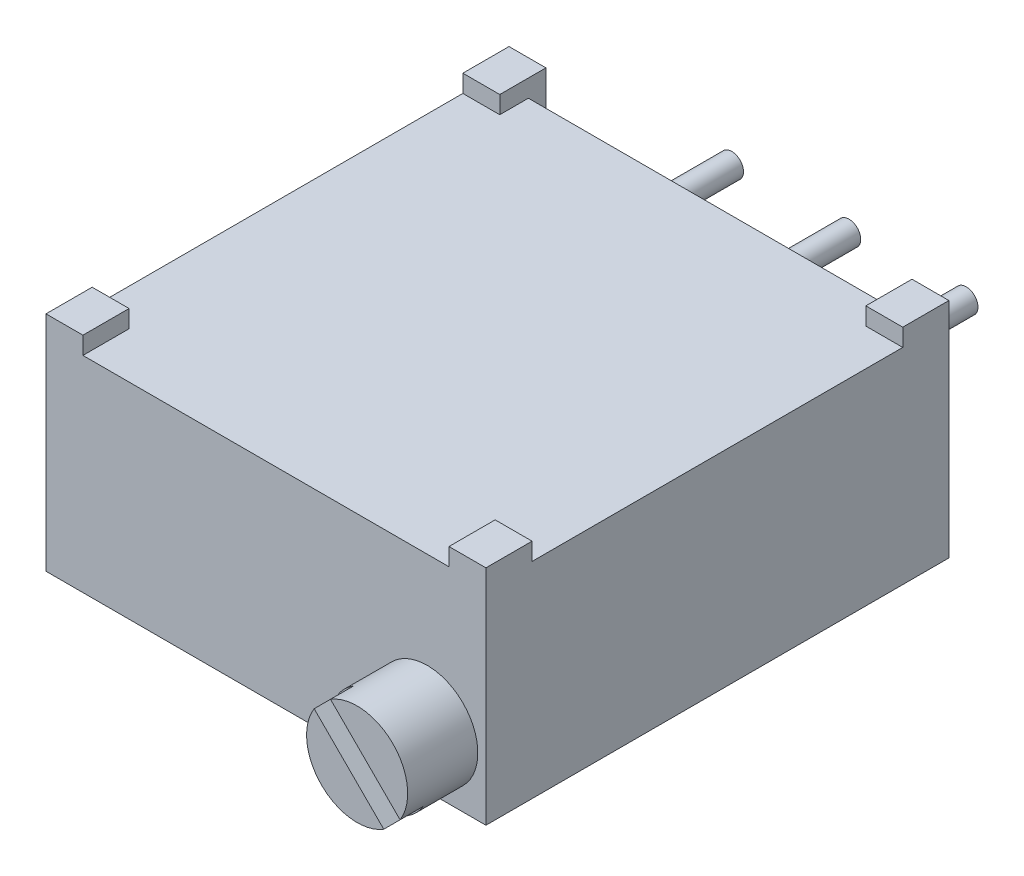
ISO-10303-21;
HEADER;
FILE_DESCRIPTION(('STEP AP214'),'2;1');
FILE_NAME('part.step','',(''),(''),'','','');
FILE_SCHEMA(('AUTOMOTIVE_DESIGN { 1 0 10303 214 1 1 1 1 }'));
ENDSEC;
DATA;
#1=APPLICATION_CONTEXT('core data for automotive mechanical design processes');
#2=APPLICATION_PROTOCOL_DEFINITION('international standard','automotive_design',2000,#1);
#3=PRODUCT_CONTEXT('',#1,'mechanical');
#4=PRODUCT('Part','Part','',(#3));
#5=PRODUCT_RELATED_PRODUCT_CATEGORY('part','',(#4));
#6=PRODUCT_DEFINITION_FORMATION('','',#4);
#7=PRODUCT_DEFINITION_CONTEXT('part definition',#1,'design');
#8=PRODUCT_DEFINITION('design','',#6,#7);
#9=PRODUCT_DEFINITION_SHAPE('','',#8);
#10=(LENGTH_UNIT() NAMED_UNIT(*) SI_UNIT(.MILLI.,.METRE.));
#11=(NAMED_UNIT(*) PLANE_ANGLE_UNIT() SI_UNIT($,.RADIAN.));
#12=(NAMED_UNIT(*) SI_UNIT($,.STERADIAN.) SOLID_ANGLE_UNIT());
#13=UNCERTAINTY_MEASURE_WITH_UNIT(LENGTH_MEASURE(1.E-05),#10,'distance_accuracy_value','');
#14=(GEOMETRIC_REPRESENTATION_CONTEXT(3) GLOBAL_UNCERTAINTY_ASSIGNED_CONTEXT((#13)) GLOBAL_UNIT_ASSIGNED_CONTEXT((#10,
#11,#12)) REPRESENTATION_CONTEXT('',''));
#15=CARTESIAN_POINT('',(0.,0.,0.));
#16=DIRECTION('',(0.,0.,1.));
#17=DIRECTION('',(1.,0.,0.));
#18=AXIS2_PLACEMENT_3D('',#15,#16,#17);
#19=CARTESIAN_POINT('',(-3.965,2.416,0.38));
#20=DIRECTION('',(0.,0.,1.));
#21=DIRECTION('',(1.,0.,0.));
#22=AXIS2_PLACEMENT_3D('',#19,#20,#21);
#23=PLANE('',#22);
#24=CARTESIAN_POINT('',(2.54,0.00499999999999949,0.380000000000001));
#25=DIRECTION('',(0.,0.,1.));
#26=DIRECTION('',(1.,0.,0.));
#27=AXIS2_PLACEMENT_3D('',#24,#25,#26);
#28=CIRCLE('',#27,0.255);
#29=CARTESIAN_POINT('',(2.795,0.00499999999999949,0.380000000000001));
#30=VERTEX_POINT('',#29);
#31=EDGE_CURVE('E40',#30,#30,#28,.F.);
#32=ORIENTED_EDGE('',*,*,#31,.F.);
#33=EDGE_LOOP('',(#32));
#34=FACE_BOUND('',#33,.T.);
#35=DIRECTION('',(-1.,0.,0.));
#36=VECTOR('',#35,1.);
#37=CARTESIAN_POINT('',(3.965,2.035,0.380000000000001));
#38=LINE('',#37,#36);
#39=CARTESIAN_POINT('',(3.965,2.035,0.380000000000001));
#40=VERTEX_POINT('',#39);
#41=CARTESIAN_POINT('',(-3.965,2.035,0.38));
#42=VERTEX_POINT('',#41);
#43=EDGE_CURVE('E216',#40,#42,#38,.T.);
#44=ORIENTED_EDGE('',*,*,#43,.F.);
#45=DIRECTION('',(0.,-1.,0.));
#46=VECTOR('',#45,1.);
#47=CARTESIAN_POINT('',(3.965,2.416,0.380000000000001));
#48=LINE('',#47,#46);
#49=CARTESIAN_POINT('',(3.965,-2.415,0.380000000000001));
#50=VERTEX_POINT('',#49);
#51=EDGE_CURVE('E300',#40,#50,#48,.T.);
#52=ORIENTED_EDGE('',*,*,#51,.T.);
#53=DIRECTION('',(-1.,0.,0.));
#54=VECTOR('',#53,1.);
#55=CARTESIAN_POINT('',(-3.965,-2.415,0.38));
#56=LINE('',#55,#54);
#57=CARTESIAN_POINT('',(-3.965,-2.415,0.38));
#58=VERTEX_POINT('',#57);
#59=EDGE_CURVE('E297',#50,#58,#56,.T.);
#60=ORIENTED_EDGE('',*,*,#59,.T.);
#61=DIRECTION('',(0.,-1.,0.));
#62=VECTOR('',#61,1.);
#63=CARTESIAN_POINT('',(-3.965,2.416,0.38));
#64=LINE('',#63,#62);
#65=EDGE_CURVE('E301',#42,#58,#64,.T.);
#66=ORIENTED_EDGE('',*,*,#65,.F.);
#67=EDGE_LOOP('',(#44,#52,#60,#66));
#68=FACE_BOUND('',#67,.T.);
#69=CARTESIAN_POINT('',(0.,0.0049999999999998,0.380000000000001));
#70=DIRECTION('',(0.,0.,1.));
#71=DIRECTION('',(1.,0.,0.));
#72=AXIS2_PLACEMENT_3D('',#69,#70,#71);
#73=CIRCLE('',#72,0.255);
#74=CARTESIAN_POINT('',(0.255,0.0049999999999998,0.380000000000001));
#75=VERTEX_POINT('',#74);
#76=EDGE_CURVE('E348',#75,#75,#73,.F.);
#77=ORIENTED_EDGE('',*,*,#76,.F.);
#78=EDGE_LOOP('',(#77));
#79=FACE_BOUND('',#78,.T.);
#80=CARTESIAN_POINT('',(-2.54,0.0049999999999998,0.38));
#81=DIRECTION('',(0.,0.,1.));
#82=DIRECTION('',(1.,0.,0.));
#83=AXIS2_PLACEMENT_3D('',#80,#81,#82);
#84=CIRCLE('',#83,0.255);
#85=CARTESIAN_POINT('',(-2.285,0.0049999999999998,0.38));
#86=VERTEX_POINT('',#85);
#87=EDGE_CURVE('E11',#86,#86,#84,.F.);
#88=ORIENTED_EDGE('',*,*,#87,.F.);
#89=EDGE_LOOP('',(#88));
#90=FACE_BOUND('',#89,.T.);
#91=ADVANCED_FACE('F32',(#34,#68,#79,#90),#23,.F.);
#92=CARTESIAN_POINT('',(3.495,-1.145,11.55));
#93=DIRECTION('',(0.,0.,1.));
#94=DIRECTION('',(1.,0.,0.));
#95=AXIS2_PLACEMENT_3D('',#92,#93,#94);
#96=PLANE('',#95);
#97=DIRECTION('',(-0.707106781186546,0.707106781186548,0.));
#98=VECTOR('',#97,1.);
#99=CARTESIAN_POINT('',(2.91794481748833,-0.214391426895054,11.55));
#100=LINE('',#99,#98);
#101=CARTESIAN_POINT('',(4.42560857310494,-1.72205518251167,11.55));
#102=VERTEX_POINT('',#101);
#103=CARTESIAN_POINT('',(2.91794481748833,-0.214391426895054,11.55));
#104=VERTEX_POINT('',#103);
#105=EDGE_CURVE('E197',#102,#104,#100,.T.);
#106=ORIENTED_EDGE('',*,*,#105,.F.);
#107=CARTESIAN_POINT('',(3.495,-1.145,11.55));
#108=DIRECTION('',(0.,0.,1.));
#109=DIRECTION('',(1.,0.,0.));
#110=AXIS2_PLACEMENT_3D('',#107,#108,#109);
#111=CIRCLE('',#110,1.095);
#112=EDGE_CURVE('E210',#102,#104,#111,.T.);
#113=ORIENTED_EDGE('',*,*,#112,.T.);
#114=EDGE_LOOP('',(#106,#113));
#115=FACE_BOUND('',#114,.T.);
#116=ADVANCED_FACE('F357',(#115),#96,.T.);
#117=CARTESIAN_POINT('',(-4.765,2.415,10.03));
#118=DIRECTION('',(0.,0.,-1.));
#119=DIRECTION('',(-1.,0.,0.));
#120=AXIS2_PLACEMENT_3D('',#117,#118,#119);
#121=PLANE('',#120);
#122=DIRECTION('',(1.,0.,0.));
#123=VECTOR('',#122,1.);
#124=CARTESIAN_POINT('',(-4.765,2.415,10.03));
#125=LINE('',#124,#123);
#126=CARTESIAN_POINT('',(3.965,2.415,10.03));
#127=VERTEX_POINT('',#126);
#128=CARTESIAN_POINT('',(4.765,2.415,10.03));
#129=VERTEX_POINT('',#128);
#130=EDGE_CURVE('E310',#127,#129,#125,.T.);
#131=ORIENTED_EDGE('',*,*,#130,.F.);
#132=DIRECTION('',(0.,1.,0.));
#133=VECTOR('',#132,1.);
#134=CARTESIAN_POINT('',(3.965,2.035,10.03));
#135=LINE('',#134,#133);
#136=CARTESIAN_POINT('',(3.965,2.035,10.03));
#137=VERTEX_POINT('',#136);
#138=EDGE_CURVE('E274',#137,#127,#135,.T.);
#139=ORIENTED_EDGE('',*,*,#138,.F.);
#140=DIRECTION('',(1.,0.,0.));
#141=VECTOR('',#140,1.);
#142=CARTESIAN_POINT('',(-3.965,2.035,10.03));
#143=LINE('',#142,#141);
#144=CARTESIAN_POINT('',(-3.965,2.035,10.03));
#145=VERTEX_POINT('',#144);
#146=EDGE_CURVE('E235',#145,#137,#143,.T.);
#147=ORIENTED_EDGE('',*,*,#146,.F.);
#148=DIRECTION('',(0.,1.,0.));
#149=VECTOR('',#148,1.);
#150=CARTESIAN_POINT('',(-3.965,2.035,10.03));
#151=LINE('',#150,#149);
#152=CARTESIAN_POINT('',(-3.965,2.415,10.03));
#153=VERTEX_POINT('',#152);
#154=EDGE_CURVE('E276',#145,#153,#151,.T.);
#155=ORIENTED_EDGE('',*,*,#154,.T.);
#156=CARTESIAN_POINT('',(-4.765,2.415,10.03));
#157=VERTEX_POINT('',#156);
#158=EDGE_CURVE('E312',#157,#153,#125,.T.);
#159=ORIENTED_EDGE('',*,*,#158,.F.);
#160=DIRECTION('',(0.,-1.,0.));
#161=VECTOR('',#160,1.);
#162=CARTESIAN_POINT('',(-4.765,2.415,10.03));
#163=LINE('',#162,#161);
#164=CARTESIAN_POINT('',(-4.765,-2.415,10.03));
#165=VERTEX_POINT('',#164);
#166=EDGE_CURVE('E342',#157,#165,#163,.T.);
#167=ORIENTED_EDGE('',*,*,#166,.T.);
#168=DIRECTION('',(1.,0.,0.));
#169=VECTOR('',#168,1.);
#170=CARTESIAN_POINT('',(-4.765,-2.415,10.03));
#171=LINE('',#170,#169);
#172=CARTESIAN_POINT('',(4.765,-2.415,10.03));
#173=VERTEX_POINT('',#172);
#174=EDGE_CURVE('E326',#165,#173,#171,.T.);
#175=ORIENTED_EDGE('',*,*,#174,.T.);
#176=DIRECTION('',(0.,-1.,0.));
#177=VECTOR('',#176,1.);
#178=CARTESIAN_POINT('',(4.765,2.415,10.03));
#179=LINE('',#178,#177);
#180=EDGE_CURVE('E339',#129,#173,#179,.T.);
#181=ORIENTED_EDGE('',*,*,#180,.F.);
#182=EDGE_LOOP('',(#131,#139,#147,#155,#159,#167,#175,#181));
#183=FACE_BOUND('',#182,.T.);
#184=CARTESIAN_POINT('',(3.495,-1.145,10.03));
#185=DIRECTION('',(0.,0.,-1.));
#186=DIRECTION('',(-1.,0.,0.));
#187=AXIS2_PLACEMENT_3D('',#184,#185,#186);
#188=CIRCLE('',#187,1.095);
#189=CARTESIAN_POINT('',(2.4,-1.145,10.03));
#190=VERTEX_POINT('',#189);
#191=EDGE_CURVE('E345',#190,#190,#188,.F.);
#192=ORIENTED_EDGE('',*,*,#191,.F.);
#193=EDGE_LOOP('',(#192));
#194=FACE_BOUND('',#193,.T.);
#195=ADVANCED_FACE('F461',(#183,#194),#121,.F.);
#196=CARTESIAN_POINT('',(0.,2.415,0.));
#197=DIRECTION('',(0.,-1.,0.));
#198=DIRECTION('',(0.,0.,-1.));
#199=AXIS2_PLACEMENT_3D('',#196,#197,#198);
#200=PLANE('',#199);
#201=DIRECTION('',(0.,0.,-1.));
#202=VECTOR('',#201,1.);
#203=CARTESIAN_POINT('',(3.965,2.415,-0.619999999999999));
#204=LINE('',#203,#202);
#205=CARTESIAN_POINT('',(3.965,2.415,1.));
#206=VERTEX_POINT('',#205);
#207=CARTESIAN_POINT('',(3.965,2.415,0.));
#208=VERTEX_POINT('',#207);
#209=EDGE_CURVE('E303',#206,#208,#204,.T.);
#210=ORIENTED_EDGE('',*,*,#209,.F.);
#211=DIRECTION('',(-1.,0.,0.));
#212=VECTOR('',#211,1.);
#213=CARTESIAN_POINT('',(4.765,2.415,0.999999999999999));
#214=LINE('',#213,#212);
#215=CARTESIAN_POINT('',(4.765,2.415,0.999999999999999));
#216=VERTEX_POINT('',#215);
#217=EDGE_CURVE('E217',#216,#206,#214,.T.);
#218=ORIENTED_EDGE('',*,*,#217,.F.);
#219=DIRECTION('',(0.,0.,-1.));
#220=VECTOR('',#219,1.);
#221=CARTESIAN_POINT('',(4.765,2.415,10.03));
#222=LINE('',#221,#220);
#223=CARTESIAN_POINT('',(4.765,2.415,0.));
#224=VERTEX_POINT('',#223);
#225=EDGE_CURVE('E315',#216,#224,#222,.T.);
#226=ORIENTED_EDGE('',*,*,#225,.T.);
#227=DIRECTION('',(-1.,0.,0.));
#228=VECTOR('',#227,1.);
#229=CARTESIAN_POINT('',(-4.765,2.415,0.));
#230=LINE('',#229,#228);
#231=EDGE_CURVE('E320',#224,#208,#230,.T.);
#232=ORIENTED_EDGE('',*,*,#231,.T.);
#233=EDGE_LOOP('',(#210,#218,#226,#232));
#234=FACE_BOUND('',#233,.T.);
#235=ADVANCED_FACE('F449',(#234),#200,.F.);
#236=CARTESIAN_POINT('',(4.765,2.415,9.03));
#237=VERTEX_POINT('',#236);
#238=EDGE_CURVE('E316',#129,#237,#222,.T.);
#239=ORIENTED_EDGE('',*,*,#238,.T.);
#240=DIRECTION('',(1.,0.,0.));
#241=VECTOR('',#240,1.);
#242=CARTESIAN_POINT('',(3.965,2.415,9.03));
#243=LINE('',#242,#241);
#244=CARTESIAN_POINT('',(3.965,2.415,9.03));
#245=VERTEX_POINT('',#244);
#246=EDGE_CURVE('E260',#245,#237,#243,.T.);
#247=ORIENTED_EDGE('',*,*,#246,.F.);
#248=DIRECTION('',(0.,0.,-1.));
#249=VECTOR('',#248,1.);
#250=CARTESIAN_POINT('',(3.965,2.415,10.03));
#251=LINE('',#250,#249);
#252=EDGE_CURVE('E257',#127,#245,#251,.T.);
#253=ORIENTED_EDGE('',*,*,#252,.F.);
#254=ORIENTED_EDGE('',*,*,#130,.T.);
#255=EDGE_LOOP('',(#239,#247,#253,#254));
#256=FACE_BOUND('',#255,.T.);
#257=ADVANCED_FACE('F468',(#256),#200,.F.);
#258=ORIENTED_EDGE('',*,*,#158,.T.);
#259=DIRECTION('',(0.,0.,1.));
#260=VECTOR('',#259,1.);
#261=CARTESIAN_POINT('',(-3.965,2.415,9.03));
#262=LINE('',#261,#260);
#263=CARTESIAN_POINT('',(-3.965,2.415,9.03));
#264=VERTEX_POINT('',#263);
#265=EDGE_CURVE('E255',#264,#153,#262,.T.);
#266=ORIENTED_EDGE('',*,*,#265,.F.);
#267=DIRECTION('',(1.,0.,0.));
#268=VECTOR('',#267,1.);
#269=CARTESIAN_POINT('',(-4.765,2.415,9.03));
#270=LINE('',#269,#268);
#271=CARTESIAN_POINT('',(-4.765,2.415,9.03));
#272=VERTEX_POINT('',#271);
#273=EDGE_CURVE('E252',#272,#264,#270,.T.);
#274=ORIENTED_EDGE('',*,*,#273,.F.);
#275=DIRECTION('',(0.,0.,1.));
#276=VECTOR('',#275,1.);
#277=CARTESIAN_POINT('',(-4.765,2.415,10.03));
#278=LINE('',#277,#276);
#279=EDGE_CURVE('E311',#272,#157,#278,.T.);
#280=ORIENTED_EDGE('',*,*,#279,.T.);
#281=EDGE_LOOP('',(#258,#266,#274,#280));
#282=FACE_BOUND('',#281,.T.);
#283=ADVANCED_FACE('F450',(#282),#200,.F.);
#284=CARTESIAN_POINT('',(-4.765,2.415,0.));
#285=DIRECTION('',(0.,0.,1.));
#286=DIRECTION('',(1.,0.,0.));
#287=AXIS2_PLACEMENT_3D('',#284,#285,#286);
#288=PLANE('',#287);
#289=CARTESIAN_POINT('',(-3.965,2.415,0.));
#290=VERTEX_POINT('',#289);
#291=CARTESIAN_POINT('',(-4.765,2.415,0.));
#292=VERTEX_POINT('',#291);
#293=EDGE_CURVE('E319',#290,#292,#230,.T.);
#294=ORIENTED_EDGE('',*,*,#293,.F.);
#295=DIRECTION('',(0.,1.,0.));
#296=VECTOR('',#295,1.);
#297=CARTESIAN_POINT('',(-3.965,2.416,0.));
#298=LINE('',#297,#296);
#299=CARTESIAN_POINT('',(-3.965,-2.415,0.));
#300=VERTEX_POINT('',#299);
#301=EDGE_CURVE('E289',#300,#290,#298,.T.);
#302=ORIENTED_EDGE('',*,*,#301,.F.);
#303=DIRECTION('',(-1.,0.,0.));
#304=VECTOR('',#303,1.);
#305=CARTESIAN_POINT('',(-4.765,-2.415,0.));
#306=LINE('',#305,#304);
#307=CARTESIAN_POINT('',(-4.765,-2.415,0.));
#308=VERTEX_POINT('',#307);
#309=EDGE_CURVE('E330',#300,#308,#306,.T.);
#310=ORIENTED_EDGE('',*,*,#309,.T.);
#311=DIRECTION('',(0.,-1.,0.));
#312=VECTOR('',#311,1.);
#313=CARTESIAN_POINT('',(-4.765,2.415,0.));
#314=LINE('',#313,#312);
#315=EDGE_CURVE('E323',#292,#308,#314,.T.);
#316=ORIENTED_EDGE('',*,*,#315,.F.);
#317=EDGE_LOOP('',(#294,#302,#310,#316));
#318=FACE_BOUND('',#317,.T.);
#319=ADVANCED_FACE('F458',(#318),#288,.F.);
#320=CARTESIAN_POINT('',(-4.765,2.415,10.03));
#321=DIRECTION('',(1.,0.,0.));
#322=DIRECTION('',(0.,0.,-1.));
#323=AXIS2_PLACEMENT_3D('',#320,#321,#322);
#324=PLANE('',#323);
#325=ORIENTED_EDGE('',*,*,#279,.F.);
#326=DIRECTION('',(0.,1.,0.));
#327=VECTOR('',#326,1.);
#328=CARTESIAN_POINT('',(-4.765,2.035,9.03));
#329=LINE('',#328,#327);
#330=CARTESIAN_POINT('',(-4.765,2.035,9.03));
#331=VERTEX_POINT('',#330);
#332=EDGE_CURVE('E281',#331,#272,#329,.T.);
#333=ORIENTED_EDGE('',*,*,#332,.F.);
#334=DIRECTION('',(0.,0.,1.));
#335=VECTOR('',#334,1.);
#336=CARTESIAN_POINT('',(-4.765,2.035,1.));
#337=LINE('',#336,#335);
#338=CARTESIAN_POINT('',(-4.765,2.035,1.));
#339=VERTEX_POINT('',#338);
#340=EDGE_CURVE('E226',#339,#331,#337,.T.);
#341=ORIENTED_EDGE('',*,*,#340,.F.);
#342=DIRECTION('',(0.,1.,0.));
#343=VECTOR('',#342,1.);
#344=CARTESIAN_POINT('',(-4.765,2.035,1.));
#345=LINE('',#344,#343);
#346=CARTESIAN_POINT('',(-4.765,2.415,1.));
#347=VERTEX_POINT('',#346);
#348=EDGE_CURVE('E283',#339,#347,#345,.T.);
#349=ORIENTED_EDGE('',*,*,#348,.T.);
#350=EDGE_CURVE('E307',#292,#347,#278,.T.);
#351=ORIENTED_EDGE('',*,*,#350,.F.);
#352=ORIENTED_EDGE('',*,*,#315,.T.);
#353=DIRECTION('',(0.,0.,1.));
#354=VECTOR('',#353,1.);
#355=CARTESIAN_POINT('',(-4.765,-2.415,10.03));
#356=LINE('',#355,#354);
#357=EDGE_CURVE('E306',#308,#165,#356,.T.);
#358=ORIENTED_EDGE('',*,*,#357,.T.);
#359=ORIENTED_EDGE('',*,*,#166,.F.);
#360=EDGE_LOOP('',(#325,#333,#341,#349,#351,#352,#358,#359));
#361=FACE_BOUND('',#360,.T.);
#362=ADVANCED_FACE('F34',(#361),#324,.F.);
#363=CARTESIAN_POINT('',(4.765,2.415,10.03));
#364=DIRECTION('',(-1.,0.,0.));
#365=DIRECTION('',(0.,0.,1.));
#366=AXIS2_PLACEMENT_3D('',#363,#364,#365);
#367=PLANE('',#366);
#368=ORIENTED_EDGE('',*,*,#225,.F.);
#369=DIRECTION('',(0.,1.,0.));
#370=VECTOR('',#369,1.);
#371=CARTESIAN_POINT('',(4.765,2.035,0.999999999999999));
#372=LINE('',#371,#370);
#373=CARTESIAN_POINT('',(4.765,2.035,0.999999999999999));
#374=VERTEX_POINT('',#373);
#375=EDGE_CURVE('E267',#374,#216,#372,.T.);
#376=ORIENTED_EDGE('',*,*,#375,.F.);
#377=DIRECTION('',(0.,0.,-1.));
#378=VECTOR('',#377,1.);
#379=CARTESIAN_POINT('',(4.765,2.035,9.03));
#380=LINE('',#379,#378);
#381=CARTESIAN_POINT('',(4.765,2.035,9.03));
#382=VERTEX_POINT('',#381);
#383=EDGE_CURVE('E244',#382,#374,#380,.T.);
#384=ORIENTED_EDGE('',*,*,#383,.F.);
#385=DIRECTION('',(0.,1.,0.));
#386=VECTOR('',#385,1.);
#387=CARTESIAN_POINT('',(4.765,2.035,9.03));
#388=LINE('',#387,#386);
#389=EDGE_CURVE('E269',#382,#237,#388,.T.);
#390=ORIENTED_EDGE('',*,*,#389,.T.);
#391=ORIENTED_EDGE('',*,*,#238,.F.);
#392=ORIENTED_EDGE('',*,*,#180,.T.);
#393=DIRECTION('',(0.,0.,-1.));
#394=VECTOR('',#393,1.);
#395=CARTESIAN_POINT('',(4.765,-2.415,10.03));
#396=LINE('',#395,#394);
#397=CARTESIAN_POINT('',(4.765,-2.415,0.));
#398=VERTEX_POINT('',#397);
#399=EDGE_CURVE('E328',#173,#398,#396,.T.);
#400=ORIENTED_EDGE('',*,*,#399,.T.);
#401=DIRECTION('',(0.,-1.,0.));
#402=VECTOR('',#401,1.);
#403=CARTESIAN_POINT('',(4.765,2.415,0.));
#404=LINE('',#403,#402);
#405=EDGE_CURVE('E336',#224,#398,#404,.T.);
#406=ORIENTED_EDGE('',*,*,#405,.F.);
#407=EDGE_LOOP('',(#368,#376,#384,#390,#391,#392,#400,#406));
#408=FACE_BOUND('',#407,.T.);
#409=ADVANCED_FACE('F456',(#408),#367,.F.);
#410=CARTESIAN_POINT('',(3.965,-2.415,0.));
#411=VERTEX_POINT('',#410);
#412=EDGE_CURVE('E331',#398,#411,#306,.T.);
#413=ORIENTED_EDGE('',*,*,#412,.T.);
#414=DIRECTION('',(0.,-1.,0.));
#415=VECTOR('',#414,1.);
#416=CARTESIAN_POINT('',(3.965,2.416,0.));
#417=LINE('',#416,#415);
#418=EDGE_CURVE('E55',#208,#411,#417,.T.);
#419=ORIENTED_EDGE('',*,*,#418,.F.);
#420=ORIENTED_EDGE('',*,*,#231,.F.);
#421=ORIENTED_EDGE('',*,*,#405,.T.);
#422=EDGE_LOOP('',(#413,#419,#420,#421));
#423=FACE_BOUND('',#422,.T.);
#424=ADVANCED_FACE('F447',(#423),#288,.F.);
#425=ORIENTED_EDGE('',*,*,#350,.T.);
#426=DIRECTION('',(-1.,0.,0.));
#427=VECTOR('',#426,1.);
#428=CARTESIAN_POINT('',(-3.965,2.415,1.));
#429=LINE('',#428,#427);
#430=CARTESIAN_POINT('',(-3.965,2.415,1.));
#431=VERTEX_POINT('',#430);
#432=EDGE_CURVE('E250',#431,#347,#429,.T.);
#433=ORIENTED_EDGE('',*,*,#432,.F.);
#434=DIRECTION('',(0.,0.,1.));
#435=VECTOR('',#434,1.);
#436=CARTESIAN_POINT('',(-3.965,2.415,-0.62));
#437=LINE('',#436,#435);
#438=EDGE_CURVE('E291',#290,#431,#437,.T.);
#439=ORIENTED_EDGE('',*,*,#438,.F.);
#440=ORIENTED_EDGE('',*,*,#293,.T.);
#441=EDGE_LOOP('',(#425,#433,#439,#440));
#442=FACE_BOUND('',#441,.T.);
#443=ADVANCED_FACE('F444',(#442),#200,.F.);
#444=CARTESIAN_POINT('',(0.,-2.415,0.));
#445=DIRECTION('',(0.,-1.,0.));
#446=DIRECTION('',(0.,0.,-1.));
#447=AXIS2_PLACEMENT_3D('',#444,#445,#446);
#448=PLANE('',#447);
#449=DIRECTION('',(0.,0.,-1.));
#450=VECTOR('',#449,1.);
#451=CARTESIAN_POINT('',(-3.965,-2.415,-0.62));
#452=LINE('',#451,#450);
#453=EDGE_CURVE('E293',#58,#300,#452,.T.);
#454=ORIENTED_EDGE('',*,*,#453,.F.);
#455=ORIENTED_EDGE('',*,*,#59,.F.);
#456=DIRECTION('',(0.,0.,1.));
#457=VECTOR('',#456,1.);
#458=CARTESIAN_POINT('',(3.965,-2.415,-0.619999999999999));
#459=LINE('',#458,#457);
#460=EDGE_CURVE('E295',#411,#50,#459,.T.);
#461=ORIENTED_EDGE('',*,*,#460,.F.);
#462=ORIENTED_EDGE('',*,*,#412,.F.);
#463=ORIENTED_EDGE('',*,*,#399,.F.);
#464=ORIENTED_EDGE('',*,*,#174,.F.);
#465=ORIENTED_EDGE('',*,*,#357,.F.);
#466=ORIENTED_EDGE('',*,*,#309,.F.);
#467=EDGE_LOOP('',(#454,#455,#461,#462,#463,#464,#465,#466));
#468=FACE_BOUND('',#467,.T.);
#469=ADVANCED_FACE('F442',(#468),#448,.T.);
#470=CARTESIAN_POINT('',(-3.965,2.416,-0.62));
#471=DIRECTION('',(-1.,0.,0.));
#472=DIRECTION('',(0.,0.,1.));
#473=AXIS2_PLACEMENT_3D('',#470,#471,#472);
#474=PLANE('',#473);
#475=ORIENTED_EDGE('',*,*,#301,.T.);
#476=ORIENTED_EDGE('',*,*,#438,.T.);
#477=DIRECTION('',(0.,1.,0.));
#478=VECTOR('',#477,1.);
#479=CARTESIAN_POINT('',(-3.965,2.035,1.));
#480=LINE('',#479,#478);
#481=CARTESIAN_POINT('',(-3.965,2.035,1.));
#482=VERTEX_POINT('',#481);
#483=EDGE_CURVE('E249',#482,#431,#480,.T.);
#484=ORIENTED_EDGE('',*,*,#483,.F.);
#485=DIRECTION('',(0.,0.,1.));
#486=VECTOR('',#485,1.);
#487=CARTESIAN_POINT('',(-3.965,2.035,0.38));
#488=LINE('',#487,#486);
#489=EDGE_CURVE('E220',#42,#482,#488,.T.);
#490=ORIENTED_EDGE('',*,*,#489,.F.);
#491=ORIENTED_EDGE('',*,*,#65,.T.);
#492=ORIENTED_EDGE('',*,*,#453,.T.);
#493=EDGE_LOOP('',(#475,#476,#484,#490,#491,#492));
#494=FACE_BOUND('',#493,.T.);
#495=ADVANCED_FACE('F439',(#494),#474,.F.);
#496=CARTESIAN_POINT('',(3.965,2.416,-0.619999999999999));
#497=DIRECTION('',(1.,0.,0.));
#498=DIRECTION('',(0.,0.,-1.));
#499=AXIS2_PLACEMENT_3D('',#496,#497,#498);
#500=PLANE('',#499);
#501=ORIENTED_EDGE('',*,*,#418,.T.);
#502=ORIENTED_EDGE('',*,*,#460,.T.);
#503=ORIENTED_EDGE('',*,*,#51,.F.);
#504=DIRECTION('',(0.,0.,-1.));
#505=VECTOR('',#504,1.);
#506=CARTESIAN_POINT('',(3.965,2.035,1.));
#507=LINE('',#506,#505);
#508=CARTESIAN_POINT('',(3.965,2.035,1.));
#509=VERTEX_POINT('',#508);
#510=EDGE_CURVE('E214',#509,#40,#507,.T.);
#511=ORIENTED_EDGE('',*,*,#510,.F.);
#512=DIRECTION('',(0.,1.,0.));
#513=VECTOR('',#512,1.);
#514=CARTESIAN_POINT('',(3.965,2.035,1.));
#515=LINE('',#514,#513);
#516=EDGE_CURVE('E264',#509,#206,#515,.T.);
#517=ORIENTED_EDGE('',*,*,#516,.T.);
#518=ORIENTED_EDGE('',*,*,#209,.T.);
#519=EDGE_LOOP('',(#501,#502,#503,#511,#517,#518));
#520=FACE_BOUND('',#519,.T.);
#521=ADVANCED_FACE('F417',(#520),#500,.F.);
#522=CARTESIAN_POINT('',(4.765,2.035,0.999999999999999));
#523=DIRECTION('',(0.,0.,-1.));
#524=DIRECTION('',(-1.,0.,0.));
#525=AXIS2_PLACEMENT_3D('',#522,#523,#524);
#526=PLANE('',#525);
#527=ORIENTED_EDGE('',*,*,#217,.T.);
#528=ORIENTED_EDGE('',*,*,#516,.F.);
#529=DIRECTION('',(-1.,0.,0.));
#530=VECTOR('',#529,1.);
#531=CARTESIAN_POINT('',(4.765,2.035,0.999999999999999));
#532=LINE('',#531,#530);
#533=EDGE_CURVE('E246',#374,#509,#532,.T.);
#534=ORIENTED_EDGE('',*,*,#533,.F.);
#535=ORIENTED_EDGE('',*,*,#375,.T.);
#536=EDGE_LOOP('',(#527,#528,#534,#535));
#537=FACE_BOUND('',#536,.T.);
#538=ADVANCED_FACE('F413',(#537),#526,.F.);
#539=CARTESIAN_POINT('',(3.965,2.035,9.03));
#540=DIRECTION('',(0.,0.,1.));
#541=DIRECTION('',(1.,0.,0.));
#542=AXIS2_PLACEMENT_3D('',#539,#540,#541);
#543=PLANE('',#542);
#544=ORIENTED_EDGE('',*,*,#246,.T.);
#545=ORIENTED_EDGE('',*,*,#389,.F.);
#546=DIRECTION('',(1.,0.,0.));
#547=VECTOR('',#546,1.);
#548=CARTESIAN_POINT('',(3.965,2.035,9.03));
#549=LINE('',#548,#547);
#550=CARTESIAN_POINT('',(3.965,2.035,9.03));
#551=VERTEX_POINT('',#550);
#552=EDGE_CURVE('E241',#551,#382,#549,.T.);
#553=ORIENTED_EDGE('',*,*,#552,.F.);
#554=DIRECTION('',(0.,1.,0.));
#555=VECTOR('',#554,1.);
#556=CARTESIAN_POINT('',(3.965,2.035,9.03));
#557=LINE('',#556,#555);
#558=EDGE_CURVE('E272',#551,#245,#557,.T.);
#559=ORIENTED_EDGE('',*,*,#558,.T.);
#560=EDGE_LOOP('',(#544,#545,#553,#559));
#561=FACE_BOUND('',#560,.T.);
#562=ADVANCED_FACE('F416',(#561),#543,.F.);
#563=CARTESIAN_POINT('',(3.965,2.035,10.03));
#564=DIRECTION('',(1.,0.,0.));
#565=DIRECTION('',(0.,0.,-1.));
#566=AXIS2_PLACEMENT_3D('',#563,#564,#565);
#567=PLANE('',#566);
#568=ORIENTED_EDGE('',*,*,#252,.T.);
#569=ORIENTED_EDGE('',*,*,#558,.F.);
#570=DIRECTION('',(0.,0.,-1.));
#571=VECTOR('',#570,1.);
#572=CARTESIAN_POINT('',(3.965,2.035,10.03));
#573=LINE('',#572,#571);
#574=EDGE_CURVE('E238',#137,#551,#573,.T.);
#575=ORIENTED_EDGE('',*,*,#574,.F.);
#576=ORIENTED_EDGE('',*,*,#138,.T.);
#577=EDGE_LOOP('',(#568,#569,#575,#576));
#578=FACE_BOUND('',#577,.T.);
#579=ADVANCED_FACE('F421',(#578),#567,.F.);
#580=CARTESIAN_POINT('',(-3.965,2.035,9.03));
#581=DIRECTION('',(-1.,0.,0.));
#582=DIRECTION('',(0.,0.,1.));
#583=AXIS2_PLACEMENT_3D('',#580,#581,#582);
#584=PLANE('',#583);
#585=ORIENTED_EDGE('',*,*,#265,.T.);
#586=ORIENTED_EDGE('',*,*,#154,.F.);
#587=DIRECTION('',(0.,0.,1.));
#588=VECTOR('',#587,1.);
#589=CARTESIAN_POINT('',(-3.965,2.035,9.03));
#590=LINE('',#589,#588);
#591=CARTESIAN_POINT('',(-3.965,2.035,9.03));
#592=VERTEX_POINT('',#591);
#593=EDGE_CURVE('E232',#592,#145,#590,.T.);
#594=ORIENTED_EDGE('',*,*,#593,.F.);
#595=DIRECTION('',(0.,1.,0.));
#596=VECTOR('',#595,1.);
#597=CARTESIAN_POINT('',(-3.965,2.035,9.03));
#598=LINE('',#597,#596);
#599=EDGE_CURVE('E279',#592,#264,#598,.T.);
#600=ORIENTED_EDGE('',*,*,#599,.T.);
#601=EDGE_LOOP('',(#585,#586,#594,#600));
#602=FACE_BOUND('',#601,.T.);
#603=ADVANCED_FACE('F425',(#602),#584,.F.);
#604=CARTESIAN_POINT('',(-4.765,2.035,9.03));
#605=DIRECTION('',(0.,0.,1.));
#606=DIRECTION('',(1.,0.,0.));
#607=AXIS2_PLACEMENT_3D('',#604,#605,#606);
#608=PLANE('',#607);
#609=ORIENTED_EDGE('',*,*,#273,.T.);
#610=ORIENTED_EDGE('',*,*,#599,.F.);
#611=DIRECTION('',(1.,0.,0.));
#612=VECTOR('',#611,1.);
#613=CARTESIAN_POINT('',(-4.765,2.035,9.03));
#614=LINE('',#613,#612);
#615=EDGE_CURVE('E229',#331,#592,#614,.T.);
#616=ORIENTED_EDGE('',*,*,#615,.F.);
#617=ORIENTED_EDGE('',*,*,#332,.T.);
#618=EDGE_LOOP('',(#609,#610,#616,#617));
#619=FACE_BOUND('',#618,.T.);
#620=ADVANCED_FACE('F429',(#619),#608,.F.);
#621=CARTESIAN_POINT('',(-3.965,2.035,1.));
#622=DIRECTION('',(0.,0.,-1.));
#623=DIRECTION('',(-1.,0.,0.));
#624=AXIS2_PLACEMENT_3D('',#621,#622,#623);
#625=PLANE('',#624);
#626=ORIENTED_EDGE('',*,*,#432,.T.);
#627=ORIENTED_EDGE('',*,*,#348,.F.);
#628=DIRECTION('',(-1.,0.,0.));
#629=VECTOR('',#628,1.);
#630=CARTESIAN_POINT('',(-3.965,2.035,1.));
#631=LINE('',#630,#629);
#632=EDGE_CURVE('E223',#482,#339,#631,.T.);
#633=ORIENTED_EDGE('',*,*,#632,.F.);
#634=ORIENTED_EDGE('',*,*,#483,.T.);
#635=EDGE_LOOP('',(#626,#627,#633,#634));
#636=FACE_BOUND('',#635,.T.);
#637=ADVANCED_FACE('F411',(#636),#625,.F.);
#638=CARTESIAN_POINT('',(0.,2.035,0.));
#639=DIRECTION('',(0.,1.,0.));
#640=DIRECTION('',(0.,0.,1.));
#641=AXIS2_PLACEMENT_3D('',#638,#639,#640);
#642=PLANE('',#641);
#643=ORIENTED_EDGE('',*,*,#510,.T.);
#644=ORIENTED_EDGE('',*,*,#43,.T.);
#645=ORIENTED_EDGE('',*,*,#489,.T.);
#646=ORIENTED_EDGE('',*,*,#632,.T.);
#647=ORIENTED_EDGE('',*,*,#340,.T.);
#648=ORIENTED_EDGE('',*,*,#615,.T.);
#649=ORIENTED_EDGE('',*,*,#593,.T.);
#650=ORIENTED_EDGE('',*,*,#146,.T.);
#651=ORIENTED_EDGE('',*,*,#574,.T.);
#652=ORIENTED_EDGE('',*,*,#552,.T.);
#653=ORIENTED_EDGE('',*,*,#383,.T.);
#654=ORIENTED_EDGE('',*,*,#533,.T.);
#655=EDGE_LOOP('',(#643,#644,#645,#646,#647,#648,#649,#650,#651,#652,#653,#654));
#656=FACE_BOUND('',#655,.T.);
#657=ADVANCED_FACE('F408',(#656),#642,.T.);
#658=CARTESIAN_POINT('',(3.495,-1.145,11.55));
#659=DIRECTION('',(0.,0.,-1.));
#660=DIRECTION('',(-1.,0.,0.));
#661=AXIS2_PLACEMENT_3D('',#658,#659,#660);
#662=CYLINDRICAL_SURFACE('',#661,1.095);
#663=CARTESIAN_POINT('',(3.495,-1.145,11.05));
#664=DIRECTION('',(0.,0.,1.));
#665=DIRECTION('',(1.,0.,0.));
#666=AXIS2_PLACEMENT_3D('',#663,#664,#665);
#667=CIRCLE('',#666,1.095);
#668=CARTESIAN_POINT('',(2.91794481748833,-0.214391426895054,11.05));
#669=VERTEX_POINT('',#668);
#670=CARTESIAN_POINT('',(2.56439142689505,-0.567944817488327,11.05));
#671=VERTEX_POINT('',#670);
#672=EDGE_CURVE('E188',#669,#671,#667,.T.);
#673=ORIENTED_EDGE('',*,*,#672,.F.);
#674=DIRECTION('',(0.,0.,1.));
#675=VECTOR('',#674,1.);
#676=CARTESIAN_POINT('',(2.91794481748833,-0.214391426895054,11.05));
#677=LINE('',#676,#675);
#678=EDGE_CURVE('E213',#669,#104,#677,.T.);
#679=ORIENTED_EDGE('',*,*,#678,.T.);
#680=ORIENTED_EDGE('',*,*,#112,.F.);
#681=DIRECTION('',(0.,0.,1.));
#682=VECTOR('',#681,1.);
#683=CARTESIAN_POINT('',(4.42560857310494,-1.72205518251167,11.05));
#684=LINE('',#683,#682);
#685=CARTESIAN_POINT('',(4.42560857310494,-1.72205518251167,11.05));
#686=VERTEX_POINT('',#685);
#687=EDGE_CURVE('E205',#686,#102,#684,.T.);
#688=ORIENTED_EDGE('',*,*,#687,.F.);
#689=CARTESIAN_POINT('',(3.495,-1.145,11.05));
#690=DIRECTION('',(0.,0.,1.));
#691=DIRECTION('',(1.,0.,0.));
#692=AXIS2_PLACEMENT_3D('',#689,#690,#691);
#693=CIRCLE('',#692,1.095);
#694=CARTESIAN_POINT('',(4.07205518251167,-2.07560857310495,11.05));
#695=VERTEX_POINT('',#694);
#696=EDGE_CURVE('E187',#695,#686,#693,.T.);
#697=ORIENTED_EDGE('',*,*,#696,.F.);
#698=DIRECTION('',(0.,0.,1.));
#699=VECTOR('',#698,1.);
#700=CARTESIAN_POINT('',(4.07205518251167,-2.07560857310495,11.05));
#701=LINE('',#700,#699);
#702=CARTESIAN_POINT('',(4.07205518251167,-2.07560857310495,11.55));
#703=VERTEX_POINT('',#702);
#704=EDGE_CURVE('E184',#695,#703,#701,.T.);
#705=ORIENTED_EDGE('',*,*,#704,.T.);
#706=CARTESIAN_POINT('',(2.56439142689505,-0.567944817488327,11.55));
#707=VERTEX_POINT('',#706);
#708=EDGE_CURVE('E203',#707,#703,#111,.T.);
#709=ORIENTED_EDGE('',*,*,#708,.F.);
#710=DIRECTION('',(0.,0.,1.));
#711=VECTOR('',#710,1.);
#712=CARTESIAN_POINT('',(2.56439142689505,-0.567944817488327,11.05));
#713=LINE('',#712,#711);
#714=EDGE_CURVE('E47',#671,#707,#713,.T.);
#715=ORIENTED_EDGE('',*,*,#714,.F.);
#716=EDGE_LOOP('',(#673,#679,#680,#688,#697,#705,#709,#715));
#717=FACE_BOUND('',#716,.T.);
#718=ORIENTED_EDGE('',*,*,#191,.T.);
#719=EDGE_LOOP('',(#718));
#720=FACE_BOUND('',#719,.T.);
#721=ADVANCED_FACE('F200',(#717,#720),#662,.T.);
#722=DIRECTION('',(0.707106781186546,-0.707106781186548,0.));
#723=VECTOR('',#722,1.);
#724=CARTESIAN_POINT('',(2.56439142689505,-0.567944817488327,11.55));
#725=LINE('',#724,#723);
#726=EDGE_CURVE('E714',#707,#703,#725,.T.);
#727=ORIENTED_EDGE('',*,*,#726,.F.);
#728=ORIENTED_EDGE('',*,*,#708,.T.);
#729=EDGE_LOOP('',(#727,#728));
#730=FACE_BOUND('',#729,.T.);
#731=ADVANCED_FACE('F399',(#730),#96,.T.);
#732=CARTESIAN_POINT('',(2.91794481748833,-0.214391426895054,11.05));
#733=DIRECTION('',(0.707106781186549,0.707106781186547,0.));
#734=DIRECTION('',(-0.707106781186546,0.707106781186549,0.));
#735=AXIS2_PLACEMENT_3D('',#732,#733,#734);
#736=PLANE('',#735);
#737=ORIENTED_EDGE('',*,*,#105,.T.);
#738=ORIENTED_EDGE('',*,*,#678,.F.);
#739=DIRECTION('',(-0.707106781186546,0.707106781186548,0.));
#740=VECTOR('',#739,1.);
#741=CARTESIAN_POINT('',(2.91794481748833,-0.214391426895054,11.05));
#742=LINE('',#741,#740);
#743=EDGE_CURVE('E194',#686,#669,#742,.T.);
#744=ORIENTED_EDGE('',*,*,#743,.F.);
#745=ORIENTED_EDGE('',*,*,#687,.T.);
#746=EDGE_LOOP('',(#737,#738,#744,#745));
#747=FACE_BOUND('',#746,.T.);
#748=ADVANCED_FACE('F396',(#747),#736,.F.);
#749=CARTESIAN_POINT('',(2.56439142689505,-0.567944817488327,11.05));
#750=DIRECTION('',(-0.707106781186549,-0.707106781186547,0.));
#751=DIRECTION('',(0.707106781186546,-0.707106781186549,0.));
#752=AXIS2_PLACEMENT_3D('',#749,#750,#751);
#753=PLANE('',#752);
#754=ORIENTED_EDGE('',*,*,#726,.T.);
#755=ORIENTED_EDGE('',*,*,#704,.F.);
#756=DIRECTION('',(0.707106781186546,-0.707106781186548,0.));
#757=VECTOR('',#756,1.);
#758=CARTESIAN_POINT('',(2.56439142689505,-0.567944817488327,11.05));
#759=LINE('',#758,#757);
#760=EDGE_CURVE('E180',#671,#695,#759,.T.);
#761=ORIENTED_EDGE('',*,*,#760,.F.);
#762=ORIENTED_EDGE('',*,*,#714,.T.);
#763=EDGE_LOOP('',(#754,#755,#761,#762));
#764=FACE_BOUND('',#763,.T.);
#765=ADVANCED_FACE('F182',(#764),#753,.F.);
#766=CARTESIAN_POINT('',(3.495,-1.145,11.05));
#767=DIRECTION('',(0.,0.,1.));
#768=DIRECTION('',(1.,0.,0.));
#769=AXIS2_PLACEMENT_3D('',#766,#767,#768);
#770=PLANE('',#769);
#771=ORIENTED_EDGE('',*,*,#672,.T.);
#772=ORIENTED_EDGE('',*,*,#760,.T.);
#773=ORIENTED_EDGE('',*,*,#696,.T.);
#774=ORIENTED_EDGE('',*,*,#743,.T.);
#775=EDGE_LOOP('',(#771,#772,#773,#774));
#776=FACE_BOUND('',#775,.T.);
#777=ADVANCED_FACE('F192',(#776),#770,.T.);
#778=CARTESIAN_POINT('',(0.,0.0049999999999998,-2.6));
#779=DIRECTION('',(0.,0.,1.));
#780=DIRECTION('',(1.,0.,0.));
#781=AXIS2_PLACEMENT_3D('',#778,#779,#780);
#782=CYLINDRICAL_SURFACE('',#781,0.255);
#783=CARTESIAN_POINT('',(0.,0.0049999999999998,-2.6));
#784=DIRECTION('',(0.,0.,-1.));
#785=DIRECTION('',(-1.,0.,0.));
#786=AXIS2_PLACEMENT_3D('',#783,#784,#785);
#787=CIRCLE('',#786,0.255);
#788=CARTESIAN_POINT('',(-0.255,0.0049999999999998,-2.6));
#789=VERTEX_POINT('',#788);
#790=EDGE_CURVE('E719',#789,#789,#787,.T.);
#791=ORIENTED_EDGE('',*,*,#790,.F.);
#792=EDGE_LOOP('',(#791));
#793=FACE_BOUND('',#792,.T.);
#794=ORIENTED_EDGE('',*,*,#76,.T.);
#795=EDGE_LOOP('',(#794));
#796=FACE_BOUND('',#795,.T.);
#797=ADVANCED_FACE('F389',(#793,#796),#782,.T.);
#798=CARTESIAN_POINT('',(0.,0.0049999999999998,-2.6));
#799=DIRECTION('',(0.,0.,-1.));
#800=DIRECTION('',(-1.,0.,0.));
#801=AXIS2_PLACEMENT_3D('',#798,#799,#800);
#802=PLANE('',#801);
#803=ORIENTED_EDGE('',*,*,#790,.T.);
#804=EDGE_LOOP('',(#803));
#805=FACE_BOUND('',#804,.T.);
#806=ADVANCED_FACE('F385',(#805),#802,.T.);
#807=CARTESIAN_POINT('',(2.54,0.00499999999999949,-2.6));
#808=DIRECTION('',(0.,0.,1.));
#809=DIRECTION('',(1.,0.,0.));
#810=AXIS2_PLACEMENT_3D('',#807,#808,#809);
#811=CYLINDRICAL_SURFACE('',#810,0.255);
#812=CARTESIAN_POINT('',(2.54,0.00499999999999949,-2.6));
#813=DIRECTION('',(0.,0.,-1.));
#814=DIRECTION('',(-1.,0.,0.));
#815=AXIS2_PLACEMENT_3D('',#812,#813,#814);
#816=CIRCLE('',#815,0.255);
#817=CARTESIAN_POINT('',(2.285,0.00499999999999949,-2.6));
#818=VERTEX_POINT('',#817);
#819=EDGE_CURVE('E724',#818,#818,#816,.T.);
#820=ORIENTED_EDGE('',*,*,#819,.F.);
#821=EDGE_LOOP('',(#820));
#822=FACE_BOUND('',#821,.T.);
#823=ORIENTED_EDGE('',*,*,#31,.T.);
#824=EDGE_LOOP('',(#823));
#825=FACE_BOUND('',#824,.T.);
#826=ADVANCED_FACE('F353',(#822,#825),#811,.T.);
#827=CARTESIAN_POINT('',(2.54,0.00499999999999949,-2.6));
#828=DIRECTION('',(0.,0.,-1.));
#829=DIRECTION('',(-1.,0.,0.));
#830=AXIS2_PLACEMENT_3D('',#827,#828,#829);
#831=PLANE('',#830);
#832=ORIENTED_EDGE('',*,*,#819,.T.);
#833=EDGE_LOOP('',(#832));
#834=FACE_BOUND('',#833,.T.);
#835=ADVANCED_FACE('F370',(#834),#831,.T.);
#836=CARTESIAN_POINT('',(-2.54,0.0049999999999998,-2.6));
#837=DIRECTION('',(0.,0.,1.));
#838=DIRECTION('',(1.,0.,0.));
#839=AXIS2_PLACEMENT_3D('',#836,#837,#838);
#840=CYLINDRICAL_SURFACE('',#839,0.255);
#841=CARTESIAN_POINT('',(-2.54,0.0049999999999998,-2.6));
#842=DIRECTION('',(0.,0.,-1.));
#843=DIRECTION('',(-1.,0.,0.));
#844=AXIS2_PLACEMENT_3D('',#841,#842,#843);
#845=CIRCLE('',#844,0.255);
#846=CARTESIAN_POINT('',(-2.795,0.0049999999999998,-2.6));
#847=VERTEX_POINT('',#846);
#848=EDGE_CURVE('E727',#847,#847,#845,.T.);
#849=ORIENTED_EDGE('',*,*,#848,.F.);
#850=EDGE_LOOP('',(#849));
#851=FACE_BOUND('',#850,.T.);
#852=ORIENTED_EDGE('',*,*,#87,.T.);
#853=EDGE_LOOP('',(#852));
#854=FACE_BOUND('',#853,.T.);
#855=ADVANCED_FACE('F367',(#851,#854),#840,.T.);
#856=CARTESIAN_POINT('',(-2.54,0.0049999999999998,-2.6));
#857=DIRECTION('',(0.,0.,-1.));
#858=DIRECTION('',(-1.,0.,0.));
#859=AXIS2_PLACEMENT_3D('',#856,#857,#858);
#860=PLANE('',#859);
#861=ORIENTED_EDGE('',*,*,#848,.T.);
#862=EDGE_LOOP('',(#861));
#863=FACE_BOUND('',#862,.T.);
#864=ADVANCED_FACE('F369',(#863),#860,.T.);
#865=CLOSED_SHELL('',(#91,#116,#195,#235,#257,#283,#319,#362,#409,#424,#443,#469,#495,#521,#538,
#562,#579,#603,#620,#637,#657,#721,#731,#748,#765,#777,#797,#806,#826,#835,#855,#864));
#866=MANIFOLD_SOLID_BREP('B2',#865);
#867=ADVANCED_BREP_SHAPE_REPRESENTATION('',(#18,#866),#14);
#868=SHAPE_DEFINITION_REPRESENTATION(#9,#867);
ENDSEC;
END-ISO-10303-21;
